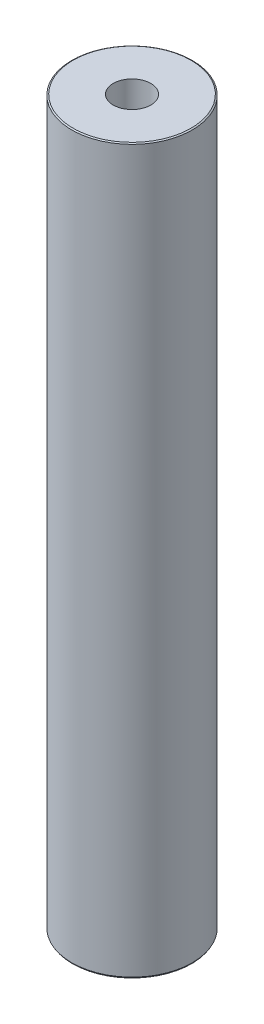
ISO-10303-21;
HEADER;
FILE_DESCRIPTION(('STEP AP214'),'2;1');
FILE_NAME('part.step','',(''),(''),'','','');
FILE_SCHEMA(('AUTOMOTIVE_DESIGN { 1 0 10303 214 1 1 1 1 }'));
ENDSEC;
DATA;
#1=APPLICATION_CONTEXT('core data for automotive mechanical design processes');
#2=APPLICATION_PROTOCOL_DEFINITION('international standard','automotive_design',2000,#1);
#3=PRODUCT_CONTEXT('',#1,'mechanical');
#4=PRODUCT('Part','Part','',(#3));
#5=PRODUCT_RELATED_PRODUCT_CATEGORY('part','',(#4));
#6=PRODUCT_DEFINITION_FORMATION('','',#4);
#7=PRODUCT_DEFINITION_CONTEXT('part definition',#1,'design');
#8=PRODUCT_DEFINITION('design','',#6,#7);
#9=PRODUCT_DEFINITION_SHAPE('','',#8);
#10=(LENGTH_UNIT() NAMED_UNIT(*) SI_UNIT(.MILLI.,.METRE.));
#11=(NAMED_UNIT(*) PLANE_ANGLE_UNIT() SI_UNIT($,.RADIAN.));
#12=(NAMED_UNIT(*) SI_UNIT($,.STERADIAN.) SOLID_ANGLE_UNIT());
#13=UNCERTAINTY_MEASURE_WITH_UNIT(LENGTH_MEASURE(1.E-05),#10,'distance_accuracy_value','');
#14=(GEOMETRIC_REPRESENTATION_CONTEXT(3) GLOBAL_UNCERTAINTY_ASSIGNED_CONTEXT((#13)) GLOBAL_UNIT_ASSIGNED_CONTEXT((#10,
#11,#12)) REPRESENTATION_CONTEXT('',''));
#15=CARTESIAN_POINT('',(0.,0.,0.));
#16=DIRECTION('',(0.,0.,1.));
#17=DIRECTION('',(1.,0.,0.));
#18=AXIS2_PLACEMENT_3D('',#15,#16,#17);
#19=CARTESIAN_POINT('',(0.,600.,0.));
#20=DIRECTION('',(0.,-1.,0.));
#21=DIRECTION('',(0.,0.,-1.));
#22=AXIS2_PLACEMENT_3D('',#19,#20,#21);
#23=CYLINDRICAL_SURFACE('',#22,50.);
#24=CARTESIAN_POINT('',(0.,599.328907441619,0.));
#25=DIRECTION('',(0.,1.,0.));
#26=DIRECTION('',(0.,0.,1.));
#27=AXIS2_PLACEMENT_3D('',#24,#25,#26);
#28=CIRCLE('',#27,50.);
#29=CARTESIAN_POINT('',(0.,599.328907441619,-50.0000000000001));
#30=VERTEX_POINT('',#29);
#31=EDGE_CURVE('E50',#30,#30,#28,.F.);
#32=ORIENTED_EDGE('',*,*,#31,.T.);
#33=EDGE_LOOP('',(#32));
#34=FACE_BOUND('',#33,.T.);
#35=CARTESIAN_POINT('',(0.,1.09731986602601,0.));
#36=DIRECTION('',(0.,1.,0.));
#37=DIRECTION('',(0.,0.,1.));
#38=AXIS2_PLACEMENT_3D('',#35,#36,#37);
#39=CIRCLE('',#38,50.);
#40=CARTESIAN_POINT('',(0.,1.09731986602601,50.));
#41=VERTEX_POINT('',#40);
#42=EDGE_CURVE('E51',#41,#41,#39,.T.);
#43=ORIENTED_EDGE('',*,*,#42,.T.);
#44=EDGE_LOOP('',(#43));
#45=FACE_BOUND('',#44,.T.);
#46=ADVANCED_FACE('F39',(#34,#45),#23,.T.);
#47=CARTESIAN_POINT('',(0.,600.,0.));
#48=DIRECTION('',(0.,1.,0.));
#49=DIRECTION('',(0.,0.,1.));
#50=AXIS2_PLACEMENT_3D('',#47,#48,#49);
#51=PLANE('',#50);
#52=CARTESIAN_POINT('',(0.,600.,0.));
#53=DIRECTION('',(0.,1.,0.));
#54=DIRECTION('',(0.,0.,1.));
#55=AXIS2_PLACEMENT_3D('',#52,#53,#54);
#56=CIRCLE('',#55,48.9026801339739);
#57=CARTESIAN_POINT('',(0.,600.,-48.902680133974));
#58=VERTEX_POINT('',#57);
#59=EDGE_CURVE('E54',#58,#58,#56,.T.);
#60=ORIENTED_EDGE('',*,*,#59,.T.);
#61=EDGE_LOOP('',(#60));
#62=FACE_BOUND('',#61,.T.);
#63=CARTESIAN_POINT('',(0.,600.,0.));
#64=DIRECTION('',(0.,1.,0.));
#65=DIRECTION('',(0.,0.,1.));
#66=AXIS2_PLACEMENT_3D('',#63,#64,#65);
#67=CIRCLE('',#66,15.5863959414274);
#68=CARTESIAN_POINT('',(0.,600.,15.5863959414274));
#69=VERTEX_POINT('',#68);
#70=EDGE_CURVE('E58',#69,#69,#67,.T.);
#71=ORIENTED_EDGE('',*,*,#70,.F.);
#72=EDGE_LOOP('',(#71));
#73=FACE_BOUND('',#72,.T.);
#74=ADVANCED_FACE('F69',(#62,#73),#51,.T.);
#75=CARTESIAN_POINT('',(0.,0.,0.));
#76=DIRECTION('',(0.,1.,0.));
#77=DIRECTION('',(0.,0.,1.));
#78=AXIS2_PLACEMENT_3D('',#75,#76,#77);
#79=PLANE('',#78);
#80=CARTESIAN_POINT('',(0.,0.,0.));
#81=DIRECTION('',(0.,1.,0.));
#82=DIRECTION('',(0.,0.,1.));
#83=AXIS2_PLACEMENT_3D('',#80,#81,#82);
#84=CIRCLE('',#83,49.3289074416186);
#85=CARTESIAN_POINT('',(0.,0.,49.3289074416186));
#86=VERTEX_POINT('',#85);
#87=EDGE_CURVE('E10',#86,#86,#84,.F.);
#88=ORIENTED_EDGE('',*,*,#87,.T.);
#89=EDGE_LOOP('',(#88));
#90=FACE_BOUND('',#89,.T.);
#91=CARTESIAN_POINT('',(0.,0.,0.));
#92=DIRECTION('',(0.,1.,0.));
#93=DIRECTION('',(0.,0.,1.));
#94=AXIS2_PLACEMENT_3D('',#91,#92,#93);
#95=CIRCLE('',#94,15.5863959414274);
#96=CARTESIAN_POINT('',(0.,0.,15.5863959414274));
#97=VERTEX_POINT('',#96);
#98=EDGE_CURVE('E63',#97,#97,#95,.T.);
#99=ORIENTED_EDGE('',*,*,#98,.T.);
#100=EDGE_LOOP('',(#99));
#101=FACE_BOUND('',#100,.T.);
#102=ADVANCED_FACE('F75',(#90,#101),#79,.F.);
#103=CARTESIAN_POINT('',(0.,600.,0.));
#104=DIRECTION('',(0.,-1.,0.));
#105=DIRECTION('',(0.,0.,-1.));
#106=AXIS2_PLACEMENT_3D('',#103,#104,#105);
#107=CYLINDRICAL_SURFACE('',#106,15.5863959414274);
#108=ORIENTED_EDGE('',*,*,#70,.T.);
#109=EDGE_LOOP('',(#108));
#110=FACE_BOUND('',#109,.T.);
#111=ORIENTED_EDGE('',*,*,#98,.F.);
#112=EDGE_LOOP('',(#111));
#113=FACE_BOUND('',#112,.T.);
#114=ADVANCED_FACE('F70',(#110,#113),#107,.F.);
#115=CARTESIAN_POINT('',(0.,600.,0.));
#116=DIRECTION('',(0.,-1.,0.));
#117=DIRECTION('',(0.,0.,-1.));
#118=AXIS2_PLACEMENT_3D('',#115,#116,#117);
#119=CONICAL_SURFACE('',#118,48.9026801339739,1.0219097974984);
#120=CARTESIAN_POINT('',(0.,599.328907441619,-50.0000000000001));
#121=CARTESIAN_POINT('',(0.,599.335897989102,-49.988569584729));
#122=CARTESIAN_POINT('',(0.,599.342888536585,-49.9771391694579));
#123=CARTESIAN_POINT('',(0.,599.356869631551,-49.9542783389157));
#124=CARTESIAN_POINT('',(0.,599.363860179034,-49.9428479236446));
#125=CARTESIAN_POINT('',(0.,599.377841274001,-49.9199870931023));
#126=CARTESIAN_POINT('',(0.,599.384831821484,-49.9085566778312));
#127=CARTESIAN_POINT('',(0.,599.39881291645,-49.885695847289));
#128=CARTESIAN_POINT('',(0.,599.405803463933,-49.8742654320179));
#129=CARTESIAN_POINT('',(0.,599.419784558899,-49.8514046014757));
#130=CARTESIAN_POINT('',(0.,599.426775106383,-49.8399741862046));
#131=CARTESIAN_POINT('',(0.,599.440756201349,-49.8171133556624));
#132=CARTESIAN_POINT('',(0.,599.447746748832,-49.8056829403913));
#133=CARTESIAN_POINT('',(0.,599.461727843798,-49.7828221098491));
#134=CARTESIAN_POINT('',(0.,599.468718391281,-49.771391694578));
#135=CARTESIAN_POINT('',(0.,599.482699486247,-49.7485308640358));
#136=CARTESIAN_POINT('',(0.,599.489690033731,-49.7371004487647));
#137=CARTESIAN_POINT('',(0.,599.503671128697,-49.7142396182225));
#138=CARTESIAN_POINT('',(0.,599.51066167618,-49.7028092029514));
#139=CARTESIAN_POINT('',(0.,599.524642771146,-49.6799483724092));
#140=CARTESIAN_POINT('',(0.,599.53163331863,-49.668517957138));
#141=CARTESIAN_POINT('',(0.,599.545614413596,-49.6456571265958));
#142=CARTESIAN_POINT('',(0.,599.552604961079,-49.6342267113247));
#143=CARTESIAN_POINT('',(0.,599.566586056045,-49.6113658807825));
#144=CARTESIAN_POINT('',(0.,599.573576603529,-49.5999354655114));
#145=CARTESIAN_POINT('',(0.,599.587557698495,-49.5770746349692));
#146=CARTESIAN_POINT('',(0.,599.594548245978,-49.5656442196981));
#147=CARTESIAN_POINT('',(0.,599.608529340944,-49.5427833891559));
#148=CARTESIAN_POINT('',(0.,599.615519888427,-49.5313529738848));
#149=CARTESIAN_POINT('',(0.,599.629500983394,-49.5084921433426));
#150=CARTESIAN_POINT('',(0.,599.636491530877,-49.4970617280715));
#151=CARTESIAN_POINT('',(0.,599.650472625843,-49.4742008975293));
#152=CARTESIAN_POINT('',(0.,599.657463173326,-49.4627704822582));
#153=CARTESIAN_POINT('',(0.,599.671444268292,-49.439909651716));
#154=CARTESIAN_POINT('',(0.,599.678434815776,-49.4284792364448));
#155=CARTESIAN_POINT('',(0.,599.692415910742,-49.4056184059026));
#156=CARTESIAN_POINT('',(0.,599.699406458225,-49.3941879906315));
#157=CARTESIAN_POINT('',(0.,599.713387553191,-49.3713271600893));
#158=CARTESIAN_POINT('',(0.,599.720378100674,-49.3598967448182));
#159=CARTESIAN_POINT('',(0.,599.734359195641,-49.337035914276));
#160=CARTESIAN_POINT('',(0.,599.741349743124,-49.3256054990049));
#161=CARTESIAN_POINT('',(0.,599.75533083809,-49.3027446684627));
#162=CARTESIAN_POINT('',(0.,599.762321385573,-49.2913142531916));
#163=CARTESIAN_POINT('',(0.,599.776302480539,-49.2684534226494));
#164=CARTESIAN_POINT('',(0.,599.783293028023,-49.2570230073783));
#165=CARTESIAN_POINT('',(0.,599.797274122989,-49.2341621768361));
#166=CARTESIAN_POINT('',(0.,599.804264670472,-49.222731761565));
#167=CARTESIAN_POINT('',(0.,599.818245765438,-49.1998709310227));
#168=CARTESIAN_POINT('',(0.,599.825236312922,-49.1884405157516));
#169=CARTESIAN_POINT('',(0.,599.839217407888,-49.1655796852094));
#170=CARTESIAN_POINT('',(0.,599.846207955371,-49.1541492699383));
#171=CARTESIAN_POINT('',(0.,599.860189050337,-49.1312884393961));
#172=CARTESIAN_POINT('',(0.,599.86717959782,-49.119858024125));
#173=CARTESIAN_POINT('',(0.,599.881160692786,-49.0969971935828));
#174=CARTESIAN_POINT('',(0.,599.88815124027,-49.0855667783117));
#175=CARTESIAN_POINT('',(0.,599.902132335236,-49.0627059477695));
#176=CARTESIAN_POINT('',(0.,599.909122882719,-49.0512755324984));
#177=CARTESIAN_POINT('',(0.,599.923103977685,-49.0284147019562));
#178=CARTESIAN_POINT('',(0.,599.930094525169,-49.0169842866851));
#179=CARTESIAN_POINT('',(0.,599.944075620135,-48.9941234561429));
#180=CARTESIAN_POINT('',(0.,599.951066167618,-48.9826930408718));
#181=CARTESIAN_POINT('',(0.,599.965047262584,-48.9598322103295));
#182=CARTESIAN_POINT('',(0.,599.972037810067,-48.9484017950584));
#183=CARTESIAN_POINT('',(0.,599.986018905034,-48.9255409645162));
#184=CARTESIAN_POINT('',(0.,599.993009452517,-48.9141105492451));
#185=CARTESIAN_POINT('',(0.,600.,-48.902680133974));
#186=B_SPLINE_CURVE_WITH_KNOTS('',3,(#120,#121,#122,#123,#124,#125,#126,#127,#128,#129,#130,
#131,#132,#133,#134,#135,#136,#137,#138,#139,#140,#141,#142,#143,#144,#145,#146,#147,#148,#149,
#150,#151,#152,#153,#154,#155,#156,#157,#158,#159,#160,#161,#162,#163,#164,#165,#166,#167,#168,
#169,#170,#171,#172,#173,#174,#175,#176,#177,#178,#179,#180,#181,#182,#183,#184,#185),
.UNSPECIFIED.,.F.,.F.,(4,2,2,2,2,2,2,2,2,2,2,2,2,2,2,2,2,2,2,2,2,2,2,2,2,2,2,2,2,2,2,2,4),(0.,
0.0401957625435755,0.0803915250870991,0.120587287630617,0.160783050174134,0.200978812717652,
0.241174575261175,0.281370337804693,0.321566100348211,0.361761862891734,0.401957625435252,
0.442153387978827,0.482349150522351,0.522544913065868,0.562740675609386,0.60293643815291,
0.643132200696427,0.683327963239945,0.723523725783468,0.763719488326986,0.803915250870504,
0.844111013414021,0.884306775957603,0.92450253850112,0.964698301044638,1.00489406358816,
1.04508982613168,1.0852855886752,1.12548135121872,1.16567711376224,1.20587287630576,
1.24606863884928,1.28626440139285),.UNSPECIFIED.);
#187=EDGE_CURVE('BSEAM81',#30,#58,#186,.T.);
#188=ORIENTED_EDGE('',*,*,#31,.F.);
#189=ORIENTED_EDGE('',*,*,#59,.F.);
#190=ORIENTED_EDGE('',*,*,#187,.T.);
#191=ORIENTED_EDGE('',*,*,#187,.F.);
#192=EDGE_LOOP('',(#188,#190,#189,#191));
#193=FACE_BOUND('',#192,.T.);
#194=ADVANCED_FACE('F81',(#193),#119,.T.);
#195=CARTESIAN_POINT('',(0.,1.09731986602601,0.));
#196=DIRECTION('',(0.,1.,0.));
#197=DIRECTION('',(0.,0.,1.));
#198=AXIS2_PLACEMENT_3D('',#195,#196,#197);
#199=CONICAL_SURFACE('',#198,50.,0.548886529296574);
#200=ORIENTED_EDGE('',*,*,#87,.F.);
#201=EDGE_LOOP('',(#200));
#202=FACE_BOUND('',#201,.T.);
#203=ORIENTED_EDGE('',*,*,#42,.F.);
#204=EDGE_LOOP('',(#203));
#205=FACE_BOUND('',#204,.T.);
#206=ADVANCED_FACE('F45',(#202,#205),#199,.T.);
#207=CLOSED_SHELL('',(#46,#74,#102,#114,#194,#206));
#208=MANIFOLD_SOLID_BREP('B2',#207);
#209=ADVANCED_BREP_SHAPE_REPRESENTATION('',(#18,#208),#14);
#210=SHAPE_DEFINITION_REPRESENTATION(#9,#209);
ENDSEC;
END-ISO-10303-21;
